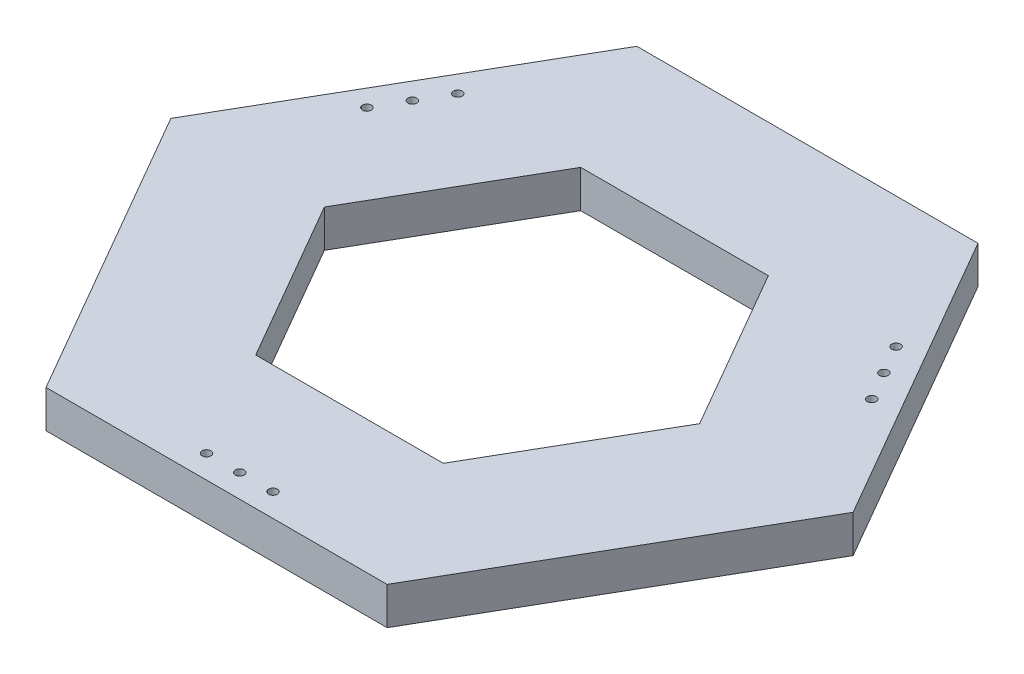
ISO-10303-21;
HEADER;
FILE_DESCRIPTION(('STEP AP214'),'2;1');
FILE_NAME('part.step','',(''),(''),'','','');
FILE_SCHEMA(('AUTOMOTIVE_DESIGN { 1 0 10303 214 1 1 1 1 }'));
ENDSEC;
DATA;
#1=APPLICATION_CONTEXT('core data for automotive mechanical design processes');
#2=APPLICATION_PROTOCOL_DEFINITION('international standard','automotive_design',2000,#1);
#3=PRODUCT_CONTEXT('',#1,'mechanical');
#4=PRODUCT('Part','Part','',(#3));
#5=PRODUCT_RELATED_PRODUCT_CATEGORY('part','',(#4));
#6=PRODUCT_DEFINITION_FORMATION('','',#4);
#7=PRODUCT_DEFINITION_CONTEXT('part definition',#1,'design');
#8=PRODUCT_DEFINITION('design','',#6,#7);
#9=PRODUCT_DEFINITION_SHAPE('','',#8);
#10=(LENGTH_UNIT() NAMED_UNIT(*) SI_UNIT(.MILLI.,.METRE.));
#11=(NAMED_UNIT(*) PLANE_ANGLE_UNIT() SI_UNIT($,.RADIAN.));
#12=(NAMED_UNIT(*) SI_UNIT($,.STERADIAN.) SOLID_ANGLE_UNIT());
#13=UNCERTAINTY_MEASURE_WITH_UNIT(LENGTH_MEASURE(1.E-05),#10,'distance_accuracy_value','');
#14=(GEOMETRIC_REPRESENTATION_CONTEXT(3) GLOBAL_UNCERTAINTY_ASSIGNED_CONTEXT((#13)) GLOBAL_UNIT_ASSIGNED_CONTEXT((#10,
#11,#12)) REPRESENTATION_CONTEXT('',''));
#15=CARTESIAN_POINT('',(0.,0.,0.));
#16=DIRECTION('',(0.,0.,1.));
#17=DIRECTION('',(1.,0.,0.));
#18=AXIS2_PLACEMENT_3D('',#15,#16,#17);
#19=CARTESIAN_POINT('',(0.,25.4,0.));
#20=DIRECTION('',(0.,1.,0.));
#21=DIRECTION('',(0.,0.,1.));
#22=AXIS2_PLACEMENT_3D('',#19,#20,#21);
#23=PLANE('',#22);
#24=CARTESIAN_POINT('',(148.358481917473,25.4,-111.635571585148));
#25=DIRECTION('',(0.,1.,0.));
#26=DIRECTION('',(0.,0.,1.));
#27=AXIS2_PLACEMENT_3D('',#24,#25,#26);
#28=CIRCLE('',#27,2.99999999999999);
#29=CARTESIAN_POINT('',(148.358481917473,25.4,-108.635571585148));
#30=VERTEX_POINT('',#29);
#31=EDGE_CURVE('E321',#30,#30,#28,.T.);
#32=ORIENTED_EDGE('',*,*,#31,.F.);
#33=EDGE_LOOP('',(#32));
#34=FACE_BOUND('',#33,.T.);
#35=CARTESIAN_POINT('',(170.858481917473,25.4,-72.6644284148485));
#36=DIRECTION('',(0.,1.,0.));
#37=DIRECTION('',(0.,0.,1.));
#38=AXIS2_PLACEMENT_3D('',#35,#36,#37);
#39=CIRCLE('',#38,3.);
#40=CARTESIAN_POINT('',(170.858481917473,25.4,-69.6644284148485));
#41=VERTEX_POINT('',#40);
#42=EDGE_CURVE('E323',#41,#41,#39,.T.);
#43=ORIENTED_EDGE('',*,*,#42,.F.);
#44=EDGE_LOOP('',(#43));
#45=FACE_BOUND('',#44,.T.);
#46=CARTESIAN_POINT('',(159.608481917473,25.4,-92.1499999999985));
#47=DIRECTION('',(0.,1.,0.));
#48=DIRECTION('',(0.,0.,1.));
#49=AXIS2_PLACEMENT_3D('',#46,#47,#48);
#50=CIRCLE('',#49,2.99999999999999);
#51=CARTESIAN_POINT('',(159.608481917473,25.4,-89.1499999999985));
#52=VERTEX_POINT('',#51);
#53=EDGE_CURVE('E329',#52,#52,#50,.T.);
#54=ORIENTED_EDGE('',*,*,#53,.F.);
#55=EDGE_LOOP('',(#54));
#56=FACE_BOUND('',#55,.T.);
#57=CARTESIAN_POINT('',(-170.858481917472,25.4,-72.6644284148509));
#58=DIRECTION('',(0.,1.,0.));
#59=DIRECTION('',(0.,0.,1.));
#60=AXIS2_PLACEMENT_3D('',#57,#58,#59);
#61=CIRCLE('',#60,3.00000000000001);
#62=CARTESIAN_POINT('',(-170.858481917472,25.4,-69.6644284148509));
#63=VERTEX_POINT('',#62);
#64=EDGE_CURVE('E335',#63,#63,#61,.T.);
#65=ORIENTED_EDGE('',*,*,#64,.F.);
#66=EDGE_LOOP('',(#65));
#67=FACE_BOUND('',#66,.T.);
#68=CARTESIAN_POINT('',(-148.358481917472,25.4,-111.635571585151));
#69=DIRECTION('',(0.,1.,0.));
#70=DIRECTION('',(0.,0.,1.));
#71=AXIS2_PLACEMENT_3D('',#68,#69,#70);
#72=CIRCLE('',#71,2.99999999999999);
#73=CARTESIAN_POINT('',(-148.358481917472,25.4,-108.635571585151));
#74=VERTEX_POINT('',#73);
#75=EDGE_CURVE('E341',#74,#74,#72,.T.);
#76=ORIENTED_EDGE('',*,*,#75,.F.);
#77=EDGE_LOOP('',(#76));
#78=FACE_BOUND('',#77,.T.);
#79=CARTESIAN_POINT('',(-159.608481917472,25.4,-92.1500000000008));
#80=DIRECTION('',(0.,1.,0.));
#81=DIRECTION('',(0.,0.,1.));
#82=AXIS2_PLACEMENT_3D('',#79,#80,#81);
#83=CIRCLE('',#82,3.00000000000001);
#84=CARTESIAN_POINT('',(-159.608481917472,25.4,-89.1500000000008));
#85=VERTEX_POINT('',#84);
#86=EDGE_CURVE('E347',#85,#85,#83,.T.);
#87=ORIENTED_EDGE('',*,*,#86,.F.);
#88=EDGE_LOOP('',(#87));
#89=FACE_BOUND('',#88,.T.);
#90=CARTESIAN_POINT('',(22.5,25.4,184.3));
#91=DIRECTION('',(0.,1.,0.));
#92=DIRECTION('',(0.,0.,1.));
#93=AXIS2_PLACEMENT_3D('',#90,#91,#92);
#94=CIRCLE('',#93,3.);
#95=CARTESIAN_POINT('',(22.5,25.4,187.3));
#96=VERTEX_POINT('',#95);
#97=EDGE_CURVE('E353',#96,#96,#94,.T.);
#98=ORIENTED_EDGE('',*,*,#97,.F.);
#99=EDGE_LOOP('',(#98));
#100=FACE_BOUND('',#99,.T.);
#101=CARTESIAN_POINT('',(-22.5,25.4,184.3));
#102=DIRECTION('',(0.,1.,0.));
#103=DIRECTION('',(0.,0.,1.));
#104=AXIS2_PLACEMENT_3D('',#101,#102,#103);
#105=CIRCLE('',#104,3.);
#106=CARTESIAN_POINT('',(-22.5,25.4,187.3));
#107=VERTEX_POINT('',#106);
#108=EDGE_CURVE('E359',#107,#107,#105,.T.);
#109=ORIENTED_EDGE('',*,*,#108,.F.);
#110=EDGE_LOOP('',(#109));
#111=FACE_BOUND('',#110,.T.);
#112=CARTESIAN_POINT('',(0.,25.4,184.3));
#113=DIRECTION('',(0.,1.,0.));
#114=DIRECTION('',(0.,0.,1.));
#115=AXIS2_PLACEMENT_3D('',#112,#113,#114);
#116=CIRCLE('',#115,3.);
#117=CARTESIAN_POINT('',(0.,25.4,187.3));
#118=VERTEX_POINT('',#117);
#119=EDGE_CURVE('E365',#118,#118,#116,.T.);
#120=ORIENTED_EDGE('',*,*,#119,.F.);
#121=EDGE_LOOP('',(#120));
#122=FACE_BOUND('',#121,.T.);
#123=DIRECTION('',(1.,0.,0.));
#124=VECTOR('',#123,1.);
#125=CARTESIAN_POINT('',(-115.470053837925,25.4,200.));
#126=LINE('',#125,#124);
#127=CARTESIAN_POINT('',(-115.470053837925,25.4,200.));
#128=VERTEX_POINT('',#127);
#129=CARTESIAN_POINT('',(115.470053837925,25.4,200.));
#130=VERTEX_POINT('',#129);
#131=EDGE_CURVE('E175',#128,#130,#126,.T.);
#132=ORIENTED_EDGE('',*,*,#131,.T.);
#133=DIRECTION('',(0.5,0.,-0.866025403784439));
#134=VECTOR('',#133,1.);
#135=CARTESIAN_POINT('',(115.470053837925,25.4,200.));
#136=LINE('',#135,#134);
#137=CARTESIAN_POINT('',(230.94010767585,25.4,-1.51878398661055E-13));
#138=VERTEX_POINT('',#137);
#139=EDGE_CURVE('E178',#130,#138,#136,.T.);
#140=ORIENTED_EDGE('',*,*,#139,.T.);
#141=DIRECTION('',(-0.5,0.,-0.866025403784438));
#142=VECTOR('',#141,1.);
#143=CARTESIAN_POINT('',(230.94010767585,25.4,-1.51878398661055E-13));
#144=LINE('',#143,#142);
#145=CARTESIAN_POINT('',(115.470053837925,25.4,-200.));
#146=VERTEX_POINT('',#145);
#147=EDGE_CURVE('E181',#138,#146,#144,.T.);
#148=ORIENTED_EDGE('',*,*,#147,.T.);
#149=DIRECTION('',(-1.,0.,0.));
#150=VECTOR('',#149,1.);
#151=CARTESIAN_POINT('',(115.470053837925,25.4,-200.));
#152=LINE('',#151,#150);
#153=CARTESIAN_POINT('',(-115.470053837925,25.4,-200.));
#154=VERTEX_POINT('',#153);
#155=EDGE_CURVE('E183',#146,#154,#152,.T.);
#156=ORIENTED_EDGE('',*,*,#155,.T.);
#157=DIRECTION('',(-0.5,0.,0.866025403784438));
#158=VECTOR('',#157,1.);
#159=CARTESIAN_POINT('',(-115.470053837925,25.4,-200.));
#160=LINE('',#159,#158);
#161=CARTESIAN_POINT('',(-230.94010767585,25.4,0.));
#162=VERTEX_POINT('',#161);
#163=EDGE_CURVE('E185',#154,#162,#160,.T.);
#164=ORIENTED_EDGE('',*,*,#163,.T.);
#165=DIRECTION('',(0.5,0.,0.866025403784438));
#166=VECTOR('',#165,1.);
#167=CARTESIAN_POINT('',(-230.94010767585,25.4,0.));
#168=LINE('',#167,#166);
#169=EDGE_CURVE('E187',#162,#128,#168,.T.);
#170=ORIENTED_EDGE('',*,*,#169,.T.);
#171=EDGE_LOOP('',(#132,#140,#148,#156,#164,#170));
#172=FACE_BOUND('',#171,.T.);
#173=DIRECTION('',(-0.5,0.,-0.866025403784439));
#174=VECTOR('',#173,1.);
#175=CARTESIAN_POINT('',(127.017059221718,25.4,0.));
#176=LINE('',#175,#174);
#177=CARTESIAN_POINT('',(127.017059221718,25.4,0.));
#178=VERTEX_POINT('',#177);
#179=CARTESIAN_POINT('',(63.5085296108588,25.4,-110.));
#180=VERTEX_POINT('',#179);
#181=EDGE_CURVE('E130',#178,#180,#176,.T.);
#182=ORIENTED_EDGE('',*,*,#181,.F.);
#183=DIRECTION('',(0.5,0.,-0.866025403784439));
#184=VECTOR('',#183,1.);
#185=CARTESIAN_POINT('',(63.5085296108589,25.4,110.));
#186=LINE('',#185,#184);
#187=CARTESIAN_POINT('',(63.5085296108589,25.4,110.));
#188=VERTEX_POINT('',#187);
#189=EDGE_CURVE('E122',#188,#178,#186,.T.);
#190=ORIENTED_EDGE('',*,*,#189,.F.);
#191=DIRECTION('',(1.,0.,0.));
#192=VECTOR('',#191,1.);
#193=CARTESIAN_POINT('',(-63.5085296108588,25.4,110.));
#194=LINE('',#193,#192);
#195=CARTESIAN_POINT('',(-63.5085296108588,25.4,110.));
#196=VERTEX_POINT('',#195);
#197=EDGE_CURVE('E152',#196,#188,#194,.T.);
#198=ORIENTED_EDGE('',*,*,#197,.F.);
#199=DIRECTION('',(0.5,0.,0.866025403784438));
#200=VECTOR('',#199,1.);
#201=CARTESIAN_POINT('',(-127.017059221718,25.4,0.));
#202=LINE('',#201,#200);
#203=CARTESIAN_POINT('',(-127.017059221718,25.4,0.));
#204=VERTEX_POINT('',#203);
#205=EDGE_CURVE('E150',#204,#196,#202,.T.);
#206=ORIENTED_EDGE('',*,*,#205,.F.);
#207=DIRECTION('',(-0.5,0.,0.866025403784439));
#208=VECTOR('',#207,1.);
#209=CARTESIAN_POINT('',(-63.5085296108589,25.4,-110.));
#210=LINE('',#209,#208);
#211=CARTESIAN_POINT('',(-63.5085296108589,25.4,-110.));
#212=VERTEX_POINT('',#211);
#213=EDGE_CURVE('E145',#212,#204,#210,.T.);
#214=ORIENTED_EDGE('',*,*,#213,.F.);
#215=DIRECTION('',(-1.,0.,0.));
#216=VECTOR('',#215,1.);
#217=CARTESIAN_POINT('',(63.5085296108588,25.4,-110.));
#218=LINE('',#217,#216);
#219=EDGE_CURVE('E143',#180,#212,#218,.T.);
#220=ORIENTED_EDGE('',*,*,#219,.F.);
#221=EDGE_LOOP('',(#182,#190,#198,#206,#214,#220));
#222=FACE_BOUND('',#221,.T.);
#223=ADVANCED_FACE('F33',(#34,#45,#56,#67,#78,#89,#100,#111,#122,#172,#222),#23,.T.);
#224=CARTESIAN_POINT('',(0.,0.,0.));
#225=DIRECTION('',(0.,1.,0.));
#226=DIRECTION('',(0.,0.,1.));
#227=AXIS2_PLACEMENT_3D('',#224,#225,#226);
#228=PLANE('',#227);
#229=CARTESIAN_POINT('',(148.358481917473,0.,-111.635571585148));
#230=DIRECTION('',(0.,1.,0.));
#231=DIRECTION('',(0.,0.,1.));
#232=AXIS2_PLACEMENT_3D('',#229,#230,#231);
#233=CIRCLE('',#232,2.99999999999999);
#234=CARTESIAN_POINT('',(148.358481917473,0.,-108.635571585148));
#235=VERTEX_POINT('',#234);
#236=EDGE_CURVE('E319',#235,#235,#233,.T.);
#237=ORIENTED_EDGE('',*,*,#236,.T.);
#238=EDGE_LOOP('',(#237));
#239=FACE_BOUND('',#238,.T.);
#240=CARTESIAN_POINT('',(170.858481917473,0.,-72.6644284148485));
#241=DIRECTION('',(0.,1.,0.));
#242=DIRECTION('',(0.,0.,1.));
#243=AXIS2_PLACEMENT_3D('',#240,#241,#242);
#244=CIRCLE('',#243,3.);
#245=CARTESIAN_POINT('',(170.858481917473,0.,-69.6644284148485));
#246=VERTEX_POINT('',#245);
#247=EDGE_CURVE('E326',#246,#246,#244,.T.);
#248=ORIENTED_EDGE('',*,*,#247,.T.);
#249=EDGE_LOOP('',(#248));
#250=FACE_BOUND('',#249,.T.);
#251=CARTESIAN_POINT('',(159.608481917473,0.,-92.1499999999985));
#252=DIRECTION('',(0.,1.,0.));
#253=DIRECTION('',(0.,0.,1.));
#254=AXIS2_PLACEMENT_3D('',#251,#252,#253);
#255=CIRCLE('',#254,2.99999999999999);
#256=CARTESIAN_POINT('',(159.608481917473,0.,-89.1499999999985));
#257=VERTEX_POINT('',#256);
#258=EDGE_CURVE('E332',#257,#257,#255,.T.);
#259=ORIENTED_EDGE('',*,*,#258,.T.);
#260=EDGE_LOOP('',(#259));
#261=FACE_BOUND('',#260,.T.);
#262=CARTESIAN_POINT('',(-170.858481917472,0.,-72.6644284148509));
#263=DIRECTION('',(0.,1.,0.));
#264=DIRECTION('',(0.,0.,1.));
#265=AXIS2_PLACEMENT_3D('',#262,#263,#264);
#266=CIRCLE('',#265,3.00000000000001);
#267=CARTESIAN_POINT('',(-170.858481917472,0.,-69.6644284148509));
#268=VERTEX_POINT('',#267);
#269=EDGE_CURVE('E338',#268,#268,#266,.T.);
#270=ORIENTED_EDGE('',*,*,#269,.T.);
#271=EDGE_LOOP('',(#270));
#272=FACE_BOUND('',#271,.T.);
#273=CARTESIAN_POINT('',(-148.358481917472,0.,-111.635571585151));
#274=DIRECTION('',(0.,1.,0.));
#275=DIRECTION('',(0.,0.,1.));
#276=AXIS2_PLACEMENT_3D('',#273,#274,#275);
#277=CIRCLE('',#276,2.99999999999999);
#278=CARTESIAN_POINT('',(-148.358481917472,0.,-108.635571585151));
#279=VERTEX_POINT('',#278);
#280=EDGE_CURVE('E344',#279,#279,#277,.T.);
#281=ORIENTED_EDGE('',*,*,#280,.T.);
#282=EDGE_LOOP('',(#281));
#283=FACE_BOUND('',#282,.T.);
#284=CARTESIAN_POINT('',(-159.608481917472,0.,-92.1500000000008));
#285=DIRECTION('',(0.,1.,0.));
#286=DIRECTION('',(0.,0.,1.));
#287=AXIS2_PLACEMENT_3D('',#284,#285,#286);
#288=CIRCLE('',#287,3.00000000000001);
#289=CARTESIAN_POINT('',(-159.608481917472,0.,-89.1500000000008));
#290=VERTEX_POINT('',#289);
#291=EDGE_CURVE('E350',#290,#290,#288,.T.);
#292=ORIENTED_EDGE('',*,*,#291,.T.);
#293=EDGE_LOOP('',(#292));
#294=FACE_BOUND('',#293,.T.);
#295=CARTESIAN_POINT('',(22.5,0.,184.3));
#296=DIRECTION('',(0.,1.,0.));
#297=DIRECTION('',(0.,0.,1.));
#298=AXIS2_PLACEMENT_3D('',#295,#296,#297);
#299=CIRCLE('',#298,3.);
#300=CARTESIAN_POINT('',(22.5,0.,187.3));
#301=VERTEX_POINT('',#300);
#302=EDGE_CURVE('E356',#301,#301,#299,.T.);
#303=ORIENTED_EDGE('',*,*,#302,.T.);
#304=EDGE_LOOP('',(#303));
#305=FACE_BOUND('',#304,.T.);
#306=CARTESIAN_POINT('',(-22.5,0.,184.3));
#307=DIRECTION('',(0.,1.,0.));
#308=DIRECTION('',(0.,0.,1.));
#309=AXIS2_PLACEMENT_3D('',#306,#307,#308);
#310=CIRCLE('',#309,3.);
#311=CARTESIAN_POINT('',(-22.5,0.,187.3));
#312=VERTEX_POINT('',#311);
#313=EDGE_CURVE('E362',#312,#312,#310,.T.);
#314=ORIENTED_EDGE('',*,*,#313,.T.);
#315=EDGE_LOOP('',(#314));
#316=FACE_BOUND('',#315,.T.);
#317=CARTESIAN_POINT('',(0.,0.,184.3));
#318=DIRECTION('',(0.,1.,0.));
#319=DIRECTION('',(0.,0.,1.));
#320=AXIS2_PLACEMENT_3D('',#317,#318,#319);
#321=CIRCLE('',#320,3.);
#322=CARTESIAN_POINT('',(0.,0.,187.3));
#323=VERTEX_POINT('',#322);
#324=EDGE_CURVE('E155',#323,#323,#321,.T.);
#325=ORIENTED_EDGE('',*,*,#324,.T.);
#326=EDGE_LOOP('',(#325));
#327=FACE_BOUND('',#326,.T.);
#328=DIRECTION('',(1.,0.,0.));
#329=VECTOR('',#328,1.);
#330=CARTESIAN_POINT('',(-115.470053837925,0.,200.));
#331=LINE('',#330,#329);
#332=CARTESIAN_POINT('',(-115.470053837925,0.,200.));
#333=VERTEX_POINT('',#332);
#334=CARTESIAN_POINT('',(115.470053837925,0.,200.));
#335=VERTEX_POINT('',#334);
#336=EDGE_CURVE('E138',#333,#335,#331,.T.);
#337=ORIENTED_EDGE('',*,*,#336,.F.);
#338=DIRECTION('',(0.5,0.,0.866025403784438));
#339=VECTOR('',#338,1.);
#340=CARTESIAN_POINT('',(-230.94010767585,0.,0.));
#341=LINE('',#340,#339);
#342=CARTESIAN_POINT('',(-230.94010767585,0.,0.));
#343=VERTEX_POINT('',#342);
#344=EDGE_CURVE('E179',#343,#333,#341,.T.);
#345=ORIENTED_EDGE('',*,*,#344,.F.);
#346=DIRECTION('',(-0.5,0.,0.866025403784438));
#347=VECTOR('',#346,1.);
#348=CARTESIAN_POINT('',(-115.470053837925,0.,-200.));
#349=LINE('',#348,#347);
#350=CARTESIAN_POINT('',(-115.470053837925,0.,-200.));
#351=VERTEX_POINT('',#350);
#352=EDGE_CURVE('E198',#351,#343,#349,.T.);
#353=ORIENTED_EDGE('',*,*,#352,.F.);
#354=DIRECTION('',(-1.,0.,0.));
#355=VECTOR('',#354,1.);
#356=CARTESIAN_POINT('',(115.470053837925,0.,-200.));
#357=LINE('',#356,#355);
#358=CARTESIAN_POINT('',(115.470053837925,0.,-200.));
#359=VERTEX_POINT('',#358);
#360=EDGE_CURVE('E196',#359,#351,#357,.T.);
#361=ORIENTED_EDGE('',*,*,#360,.F.);
#362=DIRECTION('',(-0.5,0.,-0.866025403784438));
#363=VECTOR('',#362,1.);
#364=CARTESIAN_POINT('',(230.94010767585,0.,-1.51878398661055E-13));
#365=LINE('',#364,#363);
#366=CARTESIAN_POINT('',(230.94010767585,0.,-1.51878398661055E-13));
#367=VERTEX_POINT('',#366);
#368=EDGE_CURVE('E194',#367,#359,#365,.T.);
#369=ORIENTED_EDGE('',*,*,#368,.F.);
#370=DIRECTION('',(0.5,0.,-0.866025403784439));
#371=VECTOR('',#370,1.);
#372=CARTESIAN_POINT('',(115.470053837925,0.,200.));
#373=LINE('',#372,#371);
#374=EDGE_CURVE('E192',#335,#367,#373,.T.);
#375=ORIENTED_EDGE('',*,*,#374,.F.);
#376=EDGE_LOOP('',(#337,#345,#353,#361,#369,#375));
#377=FACE_BOUND('',#376,.T.);
#378=DIRECTION('',(0.5,0.,-0.866025403784439));
#379=VECTOR('',#378,1.);
#380=CARTESIAN_POINT('',(63.5085296108589,0.,110.));
#381=LINE('',#380,#379);
#382=CARTESIAN_POINT('',(63.5085296108589,0.,110.));
#383=VERTEX_POINT('',#382);
#384=CARTESIAN_POINT('',(127.017059221718,0.,0.));
#385=VERTEX_POINT('',#384);
#386=EDGE_CURVE('E56',#383,#385,#381,.T.);
#387=ORIENTED_EDGE('',*,*,#386,.T.);
#388=DIRECTION('',(-0.5,0.,-0.866025403784439));
#389=VECTOR('',#388,1.);
#390=CARTESIAN_POINT('',(127.017059221718,0.,0.));
#391=LINE('',#390,#389);
#392=CARTESIAN_POINT('',(63.5085296108588,0.,-110.));
#393=VERTEX_POINT('',#392);
#394=EDGE_CURVE('E137',#385,#393,#391,.T.);
#395=ORIENTED_EDGE('',*,*,#394,.T.);
#396=DIRECTION('',(-1.,0.,0.));
#397=VECTOR('',#396,1.);
#398=CARTESIAN_POINT('',(63.5085296108588,0.,-110.));
#399=LINE('',#398,#397);
#400=CARTESIAN_POINT('',(-63.5085296108589,0.,-110.));
#401=VERTEX_POINT('',#400);
#402=EDGE_CURVE('E157',#393,#401,#399,.T.);
#403=ORIENTED_EDGE('',*,*,#402,.T.);
#404=DIRECTION('',(-0.5,0.,0.866025403784439));
#405=VECTOR('',#404,1.);
#406=CARTESIAN_POINT('',(-63.5085296108589,0.,-110.));
#407=LINE('',#406,#405);
#408=CARTESIAN_POINT('',(-127.017059221718,0.,0.));
#409=VERTEX_POINT('',#408);
#410=EDGE_CURVE('E160',#401,#409,#407,.T.);
#411=ORIENTED_EDGE('',*,*,#410,.T.);
#412=DIRECTION('',(0.5,0.,0.866025403784438));
#413=VECTOR('',#412,1.);
#414=CARTESIAN_POINT('',(-127.017059221718,0.,0.));
#415=LINE('',#414,#413);
#416=CARTESIAN_POINT('',(-63.5085296108588,0.,110.));
#417=VERTEX_POINT('',#416);
#418=EDGE_CURVE('E163',#409,#417,#415,.T.);
#419=ORIENTED_EDGE('',*,*,#418,.T.);
#420=DIRECTION('',(1.,0.,0.));
#421=VECTOR('',#420,1.);
#422=CARTESIAN_POINT('',(-63.5085296108588,0.,110.));
#423=LINE('',#422,#421);
#424=EDGE_CURVE('E131',#417,#383,#423,.T.);
#425=ORIENTED_EDGE('',*,*,#424,.T.);
#426=EDGE_LOOP('',(#387,#395,#403,#411,#419,#425));
#427=FACE_BOUND('',#426,.T.);
#428=ADVANCED_FACE('F222',(#239,#250,#261,#272,#283,#294,#305,#316,#327,#377,#427),#228,.F.);
#429=CARTESIAN_POINT('',(-115.470053837925,25.4,200.));
#430=DIRECTION('',(0.,0.,-1.));
#431=DIRECTION('',(-1.,0.,0.));
#432=AXIS2_PLACEMENT_3D('',#429,#430,#431);
#433=PLANE('',#432);
#434=ORIENTED_EDGE('',*,*,#336,.T.);
#435=DIRECTION('',(0.,-1.,0.));
#436=VECTOR('',#435,1.);
#437=CARTESIAN_POINT('',(115.470053837925,25.4,200.));
#438=LINE('',#437,#436);
#439=EDGE_CURVE('E11',#130,#335,#438,.T.);
#440=ORIENTED_EDGE('',*,*,#439,.F.);
#441=ORIENTED_EDGE('',*,*,#131,.F.);
#442=DIRECTION('',(0.,-1.,0.));
#443=VECTOR('',#442,1.);
#444=CARTESIAN_POINT('',(-115.470053837925,25.4,200.));
#445=LINE('',#444,#443);
#446=EDGE_CURVE('E189',#128,#333,#445,.T.);
#447=ORIENTED_EDGE('',*,*,#446,.T.);
#448=EDGE_LOOP('',(#434,#440,#441,#447));
#449=FACE_BOUND('',#448,.T.);
#450=ADVANCED_FACE('F35',(#449),#433,.F.);
#451=CARTESIAN_POINT('',(115.470053837925,25.4,200.));
#452=DIRECTION('',(-0.866025403784439,0.,-0.5));
#453=DIRECTION('',(-0.5,0.,0.866025403784439));
#454=AXIS2_PLACEMENT_3D('',#451,#452,#453);
#455=PLANE('',#454);
#456=ORIENTED_EDGE('',*,*,#374,.T.);
#457=DIRECTION('',(0.,-1.,0.));
#458=VECTOR('',#457,1.);
#459=CARTESIAN_POINT('',(230.94010767585,25.4,-1.51878398661055E-13));
#460=LINE('',#459,#458);
#461=EDGE_CURVE('E41',#138,#367,#460,.T.);
#462=ORIENTED_EDGE('',*,*,#461,.F.);
#463=ORIENTED_EDGE('',*,*,#139,.F.);
#464=ORIENTED_EDGE('',*,*,#439,.T.);
#465=EDGE_LOOP('',(#456,#462,#463,#464));
#466=FACE_BOUND('',#465,.T.);
#467=ADVANCED_FACE('F239',(#466),#455,.F.);
#468=CARTESIAN_POINT('',(230.94010767585,25.4,-1.51878398661055E-13));
#469=DIRECTION('',(-0.866025403784438,0.,0.5));
#470=DIRECTION('',(0.5,0.,0.866025403784438));
#471=AXIS2_PLACEMENT_3D('',#468,#469,#470);
#472=PLANE('',#471);
#473=ORIENTED_EDGE('',*,*,#368,.T.);
#474=DIRECTION('',(0.,-1.,0.));
#475=VECTOR('',#474,1.);
#476=CARTESIAN_POINT('',(115.470053837925,25.4,-200.));
#477=LINE('',#476,#475);
#478=EDGE_CURVE('E209',#146,#359,#477,.T.);
#479=ORIENTED_EDGE('',*,*,#478,.F.);
#480=ORIENTED_EDGE('',*,*,#147,.F.);
#481=ORIENTED_EDGE('',*,*,#461,.T.);
#482=EDGE_LOOP('',(#473,#479,#480,#481));
#483=FACE_BOUND('',#482,.T.);
#484=ADVANCED_FACE('F216',(#483),#472,.F.);
#485=CARTESIAN_POINT('',(115.470053837925,25.4,-200.));
#486=DIRECTION('',(0.,0.,1.));
#487=DIRECTION('',(1.,0.,0.));
#488=AXIS2_PLACEMENT_3D('',#485,#486,#487);
#489=PLANE('',#488);
#490=ORIENTED_EDGE('',*,*,#360,.T.);
#491=DIRECTION('',(0.,-1.,0.));
#492=VECTOR('',#491,1.);
#493=CARTESIAN_POINT('',(-115.470053837925,25.4,-200.));
#494=LINE('',#493,#492);
#495=EDGE_CURVE('E206',#154,#351,#494,.T.);
#496=ORIENTED_EDGE('',*,*,#495,.F.);
#497=ORIENTED_EDGE('',*,*,#155,.F.);
#498=ORIENTED_EDGE('',*,*,#478,.T.);
#499=EDGE_LOOP('',(#490,#496,#497,#498));
#500=FACE_BOUND('',#499,.T.);
#501=ADVANCED_FACE('F228',(#500),#489,.F.);
#502=CARTESIAN_POINT('',(-115.470053837925,25.4,-200.));
#503=DIRECTION('',(0.866025403784438,0.,0.5));
#504=DIRECTION('',(0.5,0.,-0.866025403784439));
#505=AXIS2_PLACEMENT_3D('',#502,#503,#504);
#506=PLANE('',#505);
#507=ORIENTED_EDGE('',*,*,#352,.T.);
#508=DIRECTION('',(0.,-1.,0.));
#509=VECTOR('',#508,1.);
#510=CARTESIAN_POINT('',(-230.94010767585,25.4,0.));
#511=LINE('',#510,#509);
#512=EDGE_CURVE('E203',#162,#343,#511,.T.);
#513=ORIENTED_EDGE('',*,*,#512,.F.);
#514=ORIENTED_EDGE('',*,*,#163,.F.);
#515=ORIENTED_EDGE('',*,*,#495,.T.);
#516=EDGE_LOOP('',(#507,#513,#514,#515));
#517=FACE_BOUND('',#516,.T.);
#518=ADVANCED_FACE('F232',(#517),#506,.F.);
#519=CARTESIAN_POINT('',(-230.94010767585,25.4,0.));
#520=DIRECTION('',(0.866025403784438,0.,-0.5));
#521=DIRECTION('',(-0.5,0.,-0.866025403784438));
#522=AXIS2_PLACEMENT_3D('',#519,#520,#521);
#523=PLANE('',#522);
#524=ORIENTED_EDGE('',*,*,#344,.T.);
#525=ORIENTED_EDGE('',*,*,#446,.F.);
#526=ORIENTED_EDGE('',*,*,#169,.F.);
#527=ORIENTED_EDGE('',*,*,#512,.T.);
#528=EDGE_LOOP('',(#524,#525,#526,#527));
#529=FACE_BOUND('',#528,.T.);
#530=ADVANCED_FACE('F242',(#529),#523,.F.);
#531=CARTESIAN_POINT('',(63.5085296108589,25.4,110.));
#532=DIRECTION('',(-0.866025403784439,0.,-0.5));
#533=DIRECTION('',(-0.5,0.,0.866025403784439));
#534=AXIS2_PLACEMENT_3D('',#531,#532,#533);
#535=PLANE('',#534);
#536=ORIENTED_EDGE('',*,*,#386,.F.);
#537=DIRECTION('',(0.,-1.,0.));
#538=VECTOR('',#537,1.);
#539=CARTESIAN_POINT('',(63.5085296108589,25.4,110.));
#540=LINE('',#539,#538);
#541=EDGE_CURVE('E126',#188,#383,#540,.T.);
#542=ORIENTED_EDGE('',*,*,#541,.F.);
#543=ORIENTED_EDGE('',*,*,#189,.T.);
#544=DIRECTION('',(0.,-1.,0.));
#545=VECTOR('',#544,1.);
#546=CARTESIAN_POINT('',(127.017059221718,25.4,0.));
#547=LINE('',#546,#545);
#548=EDGE_CURVE('E125',#178,#385,#547,.T.);
#549=ORIENTED_EDGE('',*,*,#548,.T.);
#550=EDGE_LOOP('',(#536,#542,#543,#549));
#551=FACE_BOUND('',#550,.T.);
#552=ADVANCED_FACE('F124',(#551),#535,.T.);
#553=CARTESIAN_POINT('',(127.017059221718,25.4,0.));
#554=DIRECTION('',(-0.866025403784439,0.,0.5));
#555=DIRECTION('',(0.5,0.,0.866025403784439));
#556=AXIS2_PLACEMENT_3D('',#553,#554,#555);
#557=PLANE('',#556);
#558=ORIENTED_EDGE('',*,*,#394,.F.);
#559=ORIENTED_EDGE('',*,*,#548,.F.);
#560=ORIENTED_EDGE('',*,*,#181,.T.);
#561=DIRECTION('',(0.,-1.,0.));
#562=VECTOR('',#561,1.);
#563=CARTESIAN_POINT('',(63.5085296108588,25.4,-110.));
#564=LINE('',#563,#562);
#565=EDGE_CURVE('E139',#180,#393,#564,.T.);
#566=ORIENTED_EDGE('',*,*,#565,.T.);
#567=EDGE_LOOP('',(#558,#559,#560,#566));
#568=FACE_BOUND('',#567,.T.);
#569=ADVANCED_FACE('F134',(#568),#557,.T.);
#570=CARTESIAN_POINT('',(63.5085296108588,25.4,-110.));
#571=DIRECTION('',(0.,0.,1.));
#572=DIRECTION('',(1.,0.,0.));
#573=AXIS2_PLACEMENT_3D('',#570,#571,#572);
#574=PLANE('',#573);
#575=ORIENTED_EDGE('',*,*,#402,.F.);
#576=ORIENTED_EDGE('',*,*,#565,.F.);
#577=ORIENTED_EDGE('',*,*,#219,.T.);
#578=DIRECTION('',(0.,-1.,0.));
#579=VECTOR('',#578,1.);
#580=CARTESIAN_POINT('',(-63.5085296108589,25.4,-110.));
#581=LINE('',#580,#579);
#582=EDGE_CURVE('E172',#212,#401,#581,.T.);
#583=ORIENTED_EDGE('',*,*,#582,.T.);
#584=EDGE_LOOP('',(#575,#576,#577,#583));
#585=FACE_BOUND('',#584,.T.);
#586=ADVANCED_FACE('F264',(#585),#574,.T.);
#587=CARTESIAN_POINT('',(-63.5085296108589,25.4,-110.));
#588=DIRECTION('',(0.866025403784439,0.,0.5));
#589=DIRECTION('',(0.5,0.,-0.866025403784439));
#590=AXIS2_PLACEMENT_3D('',#587,#588,#589);
#591=PLANE('',#590);
#592=ORIENTED_EDGE('',*,*,#410,.F.);
#593=ORIENTED_EDGE('',*,*,#582,.F.);
#594=ORIENTED_EDGE('',*,*,#213,.T.);
#595=DIRECTION('',(0.,-1.,0.));
#596=VECTOR('',#595,1.);
#597=CARTESIAN_POINT('',(-127.017059221718,25.4,0.));
#598=LINE('',#597,#596);
#599=EDGE_CURVE('E170',#204,#409,#598,.T.);
#600=ORIENTED_EDGE('',*,*,#599,.T.);
#601=EDGE_LOOP('',(#592,#593,#594,#600));
#602=FACE_BOUND('',#601,.T.);
#603=ADVANCED_FACE('F267',(#602),#591,.T.);
#604=CARTESIAN_POINT('',(-127.017059221718,25.4,0.));
#605=DIRECTION('',(0.866025403784438,0.,-0.5));
#606=DIRECTION('',(-0.5,0.,-0.866025403784439));
#607=AXIS2_PLACEMENT_3D('',#604,#605,#606);
#608=PLANE('',#607);
#609=ORIENTED_EDGE('',*,*,#418,.F.);
#610=ORIENTED_EDGE('',*,*,#599,.F.);
#611=ORIENTED_EDGE('',*,*,#205,.T.);
#612=DIRECTION('',(0.,-1.,0.));
#613=VECTOR('',#612,1.);
#614=CARTESIAN_POINT('',(-63.5085296108588,25.4,110.));
#615=LINE('',#614,#613);
#616=EDGE_CURVE('E48',#196,#417,#615,.T.);
#617=ORIENTED_EDGE('',*,*,#616,.T.);
#618=EDGE_LOOP('',(#609,#610,#611,#617));
#619=FACE_BOUND('',#618,.T.);
#620=ADVANCED_FACE('F271',(#619),#608,.T.);
#621=CARTESIAN_POINT('',(-63.5085296108588,25.4,110.));
#622=DIRECTION('',(0.,0.,-1.));
#623=DIRECTION('',(-1.,0.,0.));
#624=AXIS2_PLACEMENT_3D('',#621,#622,#623);
#625=PLANE('',#624);
#626=ORIENTED_EDGE('',*,*,#424,.F.);
#627=ORIENTED_EDGE('',*,*,#616,.F.);
#628=ORIENTED_EDGE('',*,*,#197,.T.);
#629=ORIENTED_EDGE('',*,*,#541,.T.);
#630=EDGE_LOOP('',(#626,#627,#628,#629));
#631=FACE_BOUND('',#630,.T.);
#632=ADVANCED_FACE('F275',(#631),#625,.T.);
#633=CARTESIAN_POINT('',(0.,0.,184.3));
#634=DIRECTION('',(0.,1.,0.));
#635=DIRECTION('',(0.,0.,1.));
#636=AXIS2_PLACEMENT_3D('',#633,#634,#635);
#637=CYLINDRICAL_SURFACE('',#636,3.);
#638=ORIENTED_EDGE('',*,*,#324,.F.);
#639=EDGE_LOOP('',(#638));
#640=FACE_BOUND('',#639,.T.);
#641=ORIENTED_EDGE('',*,*,#119,.T.);
#642=EDGE_LOOP('',(#641));
#643=FACE_BOUND('',#642,.T.);
#644=ADVANCED_FACE('F279',(#640,#643),#637,.F.);
#645=CARTESIAN_POINT('',(-22.5,0.,184.3));
#646=DIRECTION('',(0.,1.,0.));
#647=DIRECTION('',(0.,0.,1.));
#648=AXIS2_PLACEMENT_3D('',#645,#646,#647);
#649=CYLINDRICAL_SURFACE('',#648,3.);
#650=ORIENTED_EDGE('',*,*,#313,.F.);
#651=EDGE_LOOP('',(#650));
#652=FACE_BOUND('',#651,.T.);
#653=ORIENTED_EDGE('',*,*,#108,.T.);
#654=EDGE_LOOP('',(#653));
#655=FACE_BOUND('',#654,.T.);
#656=ADVANCED_FACE('F282',(#652,#655),#649,.F.);
#657=CARTESIAN_POINT('',(22.5,0.,184.3));
#658=DIRECTION('',(0.,1.,0.));
#659=DIRECTION('',(0.,0.,1.));
#660=AXIS2_PLACEMENT_3D('',#657,#658,#659);
#661=CYLINDRICAL_SURFACE('',#660,3.);
#662=ORIENTED_EDGE('',*,*,#302,.F.);
#663=EDGE_LOOP('',(#662));
#664=FACE_BOUND('',#663,.T.);
#665=ORIENTED_EDGE('',*,*,#97,.T.);
#666=EDGE_LOOP('',(#665));
#667=FACE_BOUND('',#666,.T.);
#668=ADVANCED_FACE('F286',(#664,#667),#661,.F.);
#669=CARTESIAN_POINT('',(-159.608481917472,0.,-92.1500000000008));
#670=DIRECTION('',(0.,1.,0.));
#671=DIRECTION('',(0.,0.,1.));
#672=AXIS2_PLACEMENT_3D('',#669,#670,#671);
#673=CYLINDRICAL_SURFACE('',#672,3.00000000000001);
#674=ORIENTED_EDGE('',*,*,#291,.F.);
#675=EDGE_LOOP('',(#674));
#676=FACE_BOUND('',#675,.T.);
#677=ORIENTED_EDGE('',*,*,#86,.T.);
#678=EDGE_LOOP('',(#677));
#679=FACE_BOUND('',#678,.T.);
#680=ADVANCED_FACE('F290',(#676,#679),#673,.F.);
#681=CARTESIAN_POINT('',(-148.358481917472,0.,-111.635571585151));
#682=DIRECTION('',(0.,1.,0.));
#683=DIRECTION('',(0.,0.,1.));
#684=AXIS2_PLACEMENT_3D('',#681,#682,#683);
#685=CYLINDRICAL_SURFACE('',#684,2.99999999999999);
#686=ORIENTED_EDGE('',*,*,#280,.F.);
#687=EDGE_LOOP('',(#686));
#688=FACE_BOUND('',#687,.T.);
#689=ORIENTED_EDGE('',*,*,#75,.T.);
#690=EDGE_LOOP('',(#689));
#691=FACE_BOUND('',#690,.T.);
#692=ADVANCED_FACE('F294',(#688,#691),#685,.F.);
#693=CARTESIAN_POINT('',(-170.858481917472,0.,-72.6644284148509));
#694=DIRECTION('',(0.,1.,0.));
#695=DIRECTION('',(0.,0.,1.));
#696=AXIS2_PLACEMENT_3D('',#693,#694,#695);
#697=CYLINDRICAL_SURFACE('',#696,3.00000000000001);
#698=ORIENTED_EDGE('',*,*,#269,.F.);
#699=EDGE_LOOP('',(#698));
#700=FACE_BOUND('',#699,.T.);
#701=ORIENTED_EDGE('',*,*,#64,.T.);
#702=EDGE_LOOP('',(#701));
#703=FACE_BOUND('',#702,.T.);
#704=ADVANCED_FACE('F298',(#700,#703),#697,.F.);
#705=CARTESIAN_POINT('',(159.608481917473,0.,-92.1499999999985));
#706=DIRECTION('',(0.,1.,0.));
#707=DIRECTION('',(0.,0.,1.));
#708=AXIS2_PLACEMENT_3D('',#705,#706,#707);
#709=CYLINDRICAL_SURFACE('',#708,2.99999999999999);
#710=ORIENTED_EDGE('',*,*,#258,.F.);
#711=EDGE_LOOP('',(#710));
#712=FACE_BOUND('',#711,.T.);
#713=ORIENTED_EDGE('',*,*,#53,.T.);
#714=EDGE_LOOP('',(#713));
#715=FACE_BOUND('',#714,.T.);
#716=ADVANCED_FACE('F302',(#712,#715),#709,.F.);
#717=CARTESIAN_POINT('',(170.858481917473,0.,-72.6644284148485));
#718=DIRECTION('',(0.,1.,0.));
#719=DIRECTION('',(0.,0.,1.));
#720=AXIS2_PLACEMENT_3D('',#717,#718,#719);
#721=CYLINDRICAL_SURFACE('',#720,3.);
#722=ORIENTED_EDGE('',*,*,#247,.F.);
#723=EDGE_LOOP('',(#722));
#724=FACE_BOUND('',#723,.T.);
#725=ORIENTED_EDGE('',*,*,#42,.T.);
#726=EDGE_LOOP('',(#725));
#727=FACE_BOUND('',#726,.T.);
#728=ADVANCED_FACE('F306',(#724,#727),#721,.F.);
#729=CARTESIAN_POINT('',(148.358481917473,0.,-111.635571585148));
#730=DIRECTION('',(0.,1.,0.));
#731=DIRECTION('',(0.,0.,1.));
#732=AXIS2_PLACEMENT_3D('',#729,#730,#731);
#733=CYLINDRICAL_SURFACE('',#732,2.99999999999999);
#734=ORIENTED_EDGE('',*,*,#236,.F.);
#735=EDGE_LOOP('',(#734));
#736=FACE_BOUND('',#735,.T.);
#737=ORIENTED_EDGE('',*,*,#31,.T.);
#738=EDGE_LOOP('',(#737));
#739=FACE_BOUND('',#738,.T.);
#740=ADVANCED_FACE('F310',(#736,#739),#733,.F.);
#741=CLOSED_SHELL('',(#223,#428,#450,#467,#484,#501,#518,#530,#552,#569,#586,#603,#620,#632,
#644,#656,#668,#680,#692,#704,#716,#728,#740));
#742=MANIFOLD_SOLID_BREP('B2',#741);
#743=ADVANCED_BREP_SHAPE_REPRESENTATION('',(#18,#742),#14);
#744=SHAPE_DEFINITION_REPRESENTATION(#9,#743);
ENDSEC;
END-ISO-10303-21;
